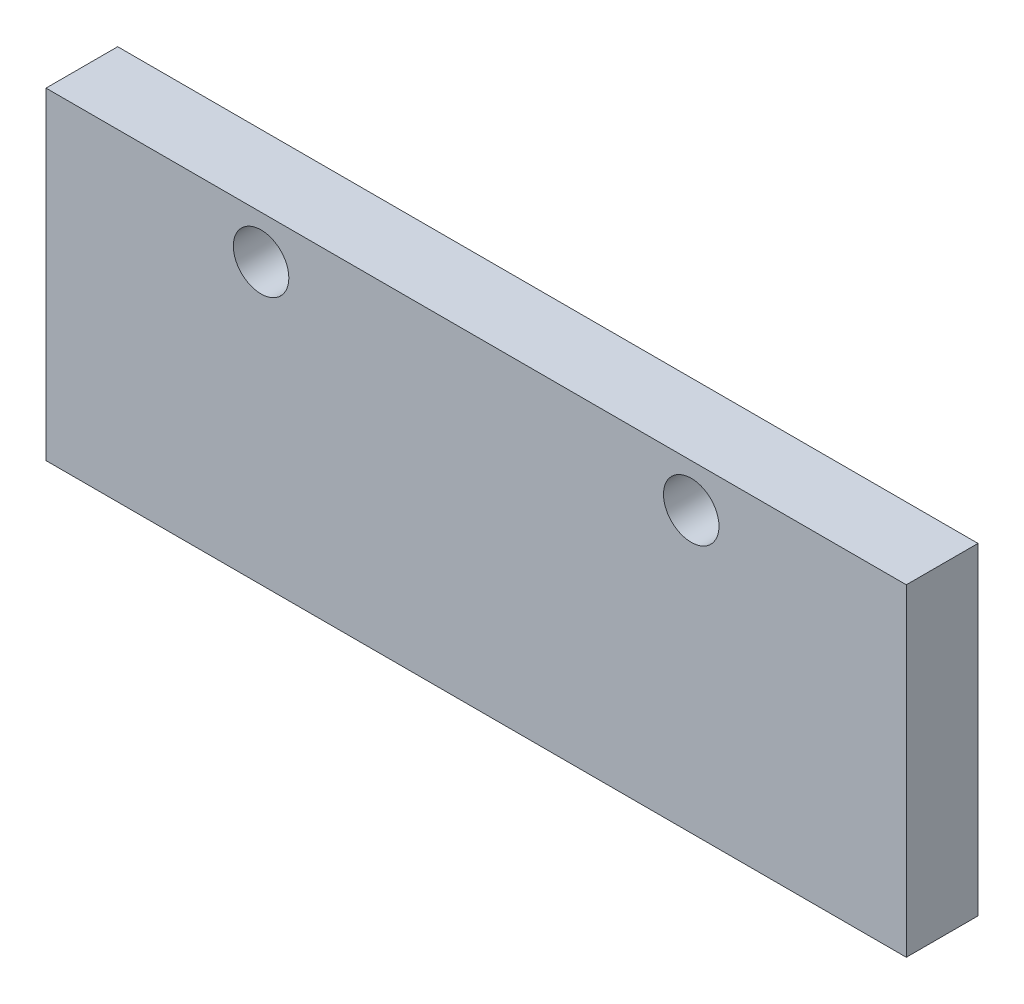
ISO-10303-21;
HEADER;
FILE_DESCRIPTION(('STEP AP214'),'2;1');
FILE_NAME('part.step','',(''),(''),'','','');
FILE_SCHEMA(('AUTOMOTIVE_DESIGN { 1 0 10303 214 1 1 1 1 }'));
ENDSEC;
DATA;
#1=APPLICATION_CONTEXT('core data for automotive mechanical design processes');
#2=APPLICATION_PROTOCOL_DEFINITION('international standard','automotive_design',2000,#1);
#3=PRODUCT_CONTEXT('',#1,'mechanical');
#4=PRODUCT('Part','Part','',(#3));
#5=PRODUCT_RELATED_PRODUCT_CATEGORY('part','',(#4));
#6=PRODUCT_DEFINITION_FORMATION('','',#4);
#7=PRODUCT_DEFINITION_CONTEXT('part definition',#1,'design');
#8=PRODUCT_DEFINITION('design','',#6,#7);
#9=PRODUCT_DEFINITION_SHAPE('','',#8);
#10=(LENGTH_UNIT() NAMED_UNIT(*) SI_UNIT(.MILLI.,.METRE.));
#11=(NAMED_UNIT(*) PLANE_ANGLE_UNIT() SI_UNIT($,.RADIAN.));
#12=(NAMED_UNIT(*) SI_UNIT($,.STERADIAN.) SOLID_ANGLE_UNIT());
#13=UNCERTAINTY_MEASURE_WITH_UNIT(LENGTH_MEASURE(1.E-05),#10,'distance_accuracy_value','');
#14=(GEOMETRIC_REPRESENTATION_CONTEXT(3) GLOBAL_UNCERTAINTY_ASSIGNED_CONTEXT((#13)) GLOBAL_UNIT_ASSIGNED_CONTEXT((#10,
#11,#12)) REPRESENTATION_CONTEXT('',''));
#15=CARTESIAN_POINT('',(0.,0.,0.));
#16=DIRECTION('',(0.,0.,1.));
#17=DIRECTION('',(1.,0.,0.));
#18=AXIS2_PLACEMENT_3D('',#15,#16,#17);
#19=CARTESIAN_POINT('',(38.1,14.2875,6.35));
#20=DIRECTION('',(-1.,0.,0.));
#21=DIRECTION('',(0.,-1.,0.));
#22=AXIS2_PLACEMENT_3D('',#19,#20,#21);
#23=PLANE('',#22);
#24=DIRECTION('',(0.,1.,0.));
#25=VECTOR('',#24,1.);
#26=CARTESIAN_POINT('',(38.1,14.2875,0.));
#27=LINE('',#26,#25);
#28=CARTESIAN_POINT('',(38.1,-14.2875,0.));
#29=VERTEX_POINT('',#28);
#30=CARTESIAN_POINT('',(38.1,14.2875,0.));
#31=VERTEX_POINT('',#30);
#32=EDGE_CURVE('E96',#29,#31,#27,.T.);
#33=ORIENTED_EDGE('',*,*,#32,.T.);
#34=DIRECTION('',(0.,0.,-1.));
#35=VECTOR('',#34,1.);
#36=CARTESIAN_POINT('',(38.1,14.2875,6.35));
#37=LINE('',#36,#35);
#38=CARTESIAN_POINT('',(38.1,14.2875,6.35));
#39=VERTEX_POINT('',#38);
#40=EDGE_CURVE('E11',#39,#31,#37,.T.);
#41=ORIENTED_EDGE('',*,*,#40,.F.);
#42=DIRECTION('',(0.,1.,0.));
#43=VECTOR('',#42,1.);
#44=CARTESIAN_POINT('',(38.1,14.2875,6.35));
#45=LINE('',#44,#43);
#46=CARTESIAN_POINT('',(38.1,-14.2875,6.35));
#47=VERTEX_POINT('',#46);
#48=EDGE_CURVE('E84',#47,#39,#45,.T.);
#49=ORIENTED_EDGE('',*,*,#48,.F.);
#50=DIRECTION('',(0.,0.,-1.));
#51=VECTOR('',#50,1.);
#52=CARTESIAN_POINT('',(38.1,-14.2875,6.35));
#53=LINE('',#52,#51);
#54=EDGE_CURVE('E92',#47,#29,#53,.T.);
#55=ORIENTED_EDGE('',*,*,#54,.T.);
#56=EDGE_LOOP('',(#33,#41,#49,#55));
#57=FACE_BOUND('',#56,.T.);
#58=ADVANCED_FACE('F33',(#57),#23,.F.);
#59=CARTESIAN_POINT('',(-38.1,14.2875,6.35));
#60=DIRECTION('',(0.,-1.,0.));
#61=DIRECTION('',(0.,0.,-1.));
#62=AXIS2_PLACEMENT_3D('',#59,#60,#61);
#63=PLANE('',#62);
#64=DIRECTION('',(-1.,0.,0.));
#65=VECTOR('',#64,1.);
#66=CARTESIAN_POINT('',(-38.1,14.2875,0.));
#67=LINE('',#66,#65);
#68=CARTESIAN_POINT('',(-38.1,14.2875,0.));
#69=VERTEX_POINT('',#68);
#70=EDGE_CURVE('E88',#31,#69,#67,.T.);
#71=ORIENTED_EDGE('',*,*,#70,.T.);
#72=DIRECTION('',(0.,0.,-1.));
#73=VECTOR('',#72,1.);
#74=CARTESIAN_POINT('',(-38.1,14.2875,6.35));
#75=LINE('',#74,#73);
#76=CARTESIAN_POINT('',(-38.1,14.2875,6.35));
#77=VERTEX_POINT('',#76);
#78=EDGE_CURVE('E41',#77,#69,#75,.T.);
#79=ORIENTED_EDGE('',*,*,#78,.F.);
#80=DIRECTION('',(-1.,0.,0.));
#81=VECTOR('',#80,1.);
#82=CARTESIAN_POINT('',(-38.1,14.2875,6.35));
#83=LINE('',#82,#81);
#84=EDGE_CURVE('E79',#39,#77,#83,.T.);
#85=ORIENTED_EDGE('',*,*,#84,.F.);
#86=ORIENTED_EDGE('',*,*,#40,.T.);
#87=EDGE_LOOP('',(#71,#79,#85,#86));
#88=FACE_BOUND('',#87,.T.);
#89=ADVANCED_FACE('F87',(#88),#63,.F.);
#90=CARTESIAN_POINT('',(-38.1,14.2875,6.35));
#91=DIRECTION('',(1.,0.,0.));
#92=DIRECTION('',(0.,1.,0.));
#93=AXIS2_PLACEMENT_3D('',#90,#91,#92);
#94=PLANE('',#93);
#95=DIRECTION('',(0.,-1.,0.));
#96=VECTOR('',#95,1.);
#97=CARTESIAN_POINT('',(-38.1,14.2875,0.));
#98=LINE('',#97,#96);
#99=CARTESIAN_POINT('',(-38.1,-14.2875,0.));
#100=VERTEX_POINT('',#99);
#101=EDGE_CURVE('E66',#69,#100,#98,.T.);
#102=ORIENTED_EDGE('',*,*,#101,.T.);
#103=DIRECTION('',(0.,0.,-1.));
#104=VECTOR('',#103,1.);
#105=CARTESIAN_POINT('',(-38.1,-14.2875,6.35));
#106=LINE('',#105,#104);
#107=CARTESIAN_POINT('',(-38.1,-14.2875,6.35));
#108=VERTEX_POINT('',#107);
#109=EDGE_CURVE('E89',#108,#100,#106,.T.);
#110=ORIENTED_EDGE('',*,*,#109,.F.);
#111=DIRECTION('',(0.,-1.,0.));
#112=VECTOR('',#111,1.);
#113=CARTESIAN_POINT('',(-38.1,14.2875,6.35));
#114=LINE('',#113,#112);
#115=EDGE_CURVE('E82',#77,#108,#114,.T.);
#116=ORIENTED_EDGE('',*,*,#115,.F.);
#117=ORIENTED_EDGE('',*,*,#78,.T.);
#118=EDGE_LOOP('',(#102,#110,#116,#117));
#119=FACE_BOUND('',#118,.T.);
#120=ADVANCED_FACE('F90',(#119),#94,.F.);
#121=CARTESIAN_POINT('',(-38.1,-14.2875,6.35));
#122=DIRECTION('',(0.,1.,0.));
#123=DIRECTION('',(0.,0.,1.));
#124=AXIS2_PLACEMENT_3D('',#121,#122,#123);
#125=PLANE('',#124);
#126=DIRECTION('',(1.,0.,0.));
#127=VECTOR('',#126,1.);
#128=CARTESIAN_POINT('',(-38.1,-14.2875,0.));
#129=LINE('',#128,#127);
#130=EDGE_CURVE('E72',#100,#29,#129,.T.);
#131=ORIENTED_EDGE('',*,*,#130,.T.);
#132=ORIENTED_EDGE('',*,*,#54,.F.);
#133=DIRECTION('',(1.,0.,0.));
#134=VECTOR('',#133,1.);
#135=CARTESIAN_POINT('',(-38.1,-14.2875,6.35));
#136=LINE('',#135,#134);
#137=EDGE_CURVE('E49',#108,#47,#136,.T.);
#138=ORIENTED_EDGE('',*,*,#137,.F.);
#139=ORIENTED_EDGE('',*,*,#109,.T.);
#140=EDGE_LOOP('',(#131,#132,#138,#139));
#141=FACE_BOUND('',#140,.T.);
#142=ADVANCED_FACE('F104',(#141),#125,.F.);
#143=CARTESIAN_POINT('',(0.,0.,6.35));
#144=DIRECTION('',(0.,0.,1.));
#145=DIRECTION('',(1.,0.,0.));
#146=AXIS2_PLACEMENT_3D('',#143,#144,#145);
#147=PLANE('',#146);
#148=CARTESIAN_POINT('',(-19.05,10.4775,6.35));
#149=DIRECTION('',(0.,0.,1.));
#150=DIRECTION('',(1.,0.,0.));
#151=AXIS2_PLACEMENT_3D('',#148,#149,#150);
#152=CIRCLE('',#151,2.45744999999999);
#153=CARTESIAN_POINT('',(-16.59255,10.4775,6.35));
#154=VERTEX_POINT('',#153);
#155=EDGE_CURVE('E118',#154,#154,#152,.T.);
#156=ORIENTED_EDGE('',*,*,#155,.F.);
#157=EDGE_LOOP('',(#156));
#158=FACE_BOUND('',#157,.T.);
#159=CARTESIAN_POINT('',(19.05,10.4775,6.35));
#160=DIRECTION('',(0.,0.,1.));
#161=DIRECTION('',(1.,0.,0.));
#162=AXIS2_PLACEMENT_3D('',#159,#160,#161);
#163=CIRCLE('',#162,2.45744999999999);
#164=CARTESIAN_POINT('',(21.50745,10.4775,6.35));
#165=VERTEX_POINT('',#164);
#166=EDGE_CURVE('E112',#165,#165,#163,.T.);
#167=ORIENTED_EDGE('',*,*,#166,.F.);
#168=EDGE_LOOP('',(#167));
#169=FACE_BOUND('',#168,.T.);
#170=ORIENTED_EDGE('',*,*,#48,.T.);
#171=ORIENTED_EDGE('',*,*,#84,.T.);
#172=ORIENTED_EDGE('',*,*,#115,.T.);
#173=ORIENTED_EDGE('',*,*,#137,.T.);
#174=EDGE_LOOP('',(#170,#171,#172,#173));
#175=FACE_BOUND('',#174,.T.);
#176=ADVANCED_FACE('F80',(#158,#169,#175),#147,.T.);
#177=CARTESIAN_POINT('',(0.,0.,0.));
#178=DIRECTION('',(0.,0.,1.));
#179=DIRECTION('',(1.,0.,0.));
#180=AXIS2_PLACEMENT_3D('',#177,#178,#179);
#181=PLANE('',#180);
#182=CARTESIAN_POINT('',(-19.05,10.4775,0.));
#183=DIRECTION('',(0.,0.,1.));
#184=DIRECTION('',(1.,0.,0.));
#185=AXIS2_PLACEMENT_3D('',#182,#183,#184);
#186=CIRCLE('',#185,2.45744999999999);
#187=CARTESIAN_POINT('',(-16.59255,10.4775,0.));
#188=VERTEX_POINT('',#187);
#189=EDGE_CURVE('E115',#188,#188,#186,.T.);
#190=ORIENTED_EDGE('',*,*,#189,.T.);
#191=EDGE_LOOP('',(#190));
#192=FACE_BOUND('',#191,.T.);
#193=CARTESIAN_POINT('',(19.05,10.4775,0.));
#194=DIRECTION('',(0.,0.,1.));
#195=DIRECTION('',(1.,0.,0.));
#196=AXIS2_PLACEMENT_3D('',#193,#194,#195);
#197=CIRCLE('',#196,2.45744999999999);
#198=CARTESIAN_POINT('',(21.50745,10.4775,0.));
#199=VERTEX_POINT('',#198);
#200=EDGE_CURVE('E99',#199,#199,#197,.T.);
#201=ORIENTED_EDGE('',*,*,#200,.T.);
#202=EDGE_LOOP('',(#201));
#203=FACE_BOUND('',#202,.T.);
#204=ORIENTED_EDGE('',*,*,#32,.F.);
#205=ORIENTED_EDGE('',*,*,#130,.F.);
#206=ORIENTED_EDGE('',*,*,#101,.F.);
#207=ORIENTED_EDGE('',*,*,#70,.F.);
#208=EDGE_LOOP('',(#204,#205,#206,#207));
#209=FACE_BOUND('',#208,.T.);
#210=ADVANCED_FACE('F107',(#192,#203,#209),#181,.F.);
#211=CARTESIAN_POINT('',(19.05,10.4775,6.35));
#212=DIRECTION('',(0.,0.,1.));
#213=DIRECTION('',(1.,0.,0.));
#214=AXIS2_PLACEMENT_3D('',#211,#212,#213);
#215=CYLINDRICAL_SURFACE('',#214,2.45744999999999);
#216=ORIENTED_EDGE('',*,*,#200,.F.);
#217=EDGE_LOOP('',(#216));
#218=FACE_BOUND('',#217,.T.);
#219=ORIENTED_EDGE('',*,*,#166,.T.);
#220=EDGE_LOOP('',(#219));
#221=FACE_BOUND('',#220,.T.);
#222=ADVANCED_FACE('F129',(#218,#221),#215,.F.);
#223=CARTESIAN_POINT('',(-19.05,10.4775,6.35));
#224=DIRECTION('',(0.,0.,1.));
#225=DIRECTION('',(1.,0.,0.));
#226=AXIS2_PLACEMENT_3D('',#223,#224,#225);
#227=CYLINDRICAL_SURFACE('',#226,2.45744999999999);
#228=ORIENTED_EDGE('',*,*,#189,.F.);
#229=EDGE_LOOP('',(#228));
#230=FACE_BOUND('',#229,.T.);
#231=ORIENTED_EDGE('',*,*,#155,.T.);
#232=EDGE_LOOP('',(#231));
#233=FACE_BOUND('',#232,.T.);
#234=ADVANCED_FACE('F122',(#230,#233),#227,.F.);
#235=CLOSED_SHELL('',(#58,#89,#120,#142,#176,#210,#222,#234));
#236=MANIFOLD_SOLID_BREP('B2',#235);
#237=ADVANCED_BREP_SHAPE_REPRESENTATION('',(#18,#236),#14);
#238=SHAPE_DEFINITION_REPRESENTATION(#9,#237);
ENDSEC;
END-ISO-10303-21;
